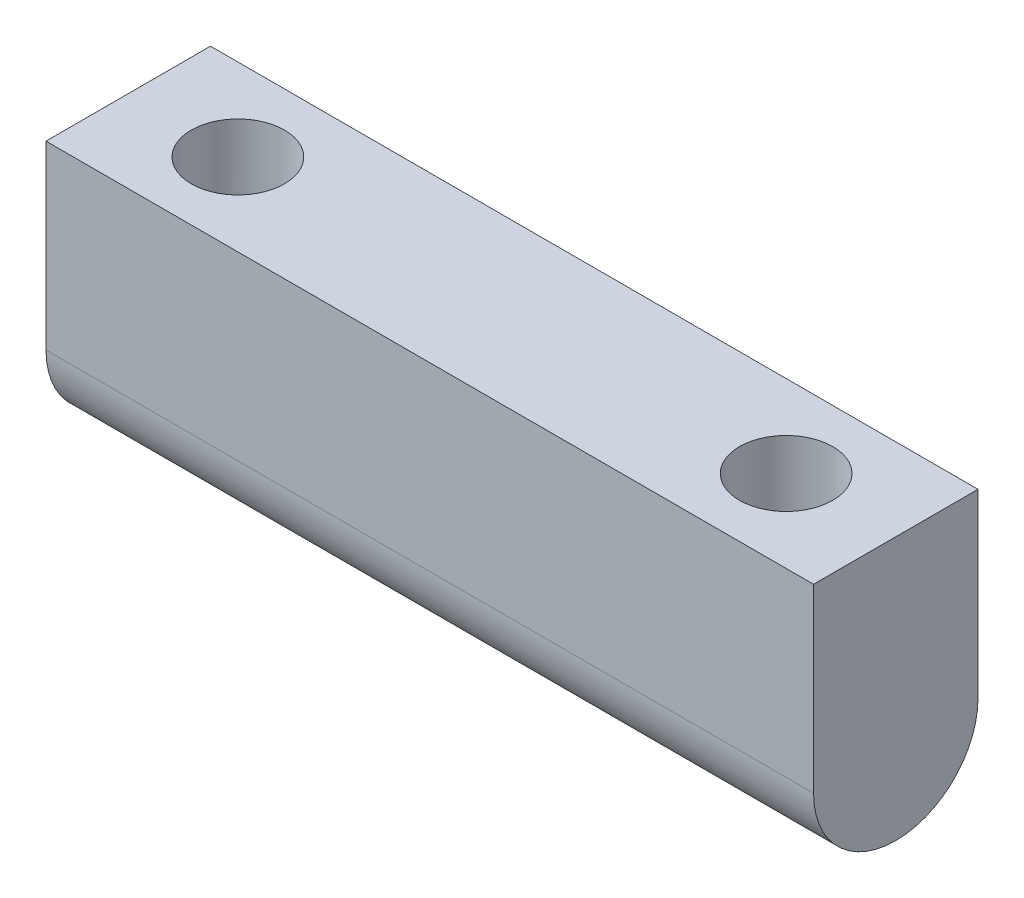
ISO-10303-21;
HEADER;
FILE_DESCRIPTION(('STEP AP214'),'2;1');
FILE_NAME('part.step','',(''),(''),'','','');
FILE_SCHEMA(('AUTOMOTIVE_DESIGN { 1 0 10303 214 1 1 1 1 }'));
ENDSEC;
DATA;
#1=APPLICATION_CONTEXT('core data for automotive mechanical design processes');
#2=APPLICATION_PROTOCOL_DEFINITION('international standard','automotive_design',2000,#1);
#3=PRODUCT_CONTEXT('',#1,'mechanical');
#4=PRODUCT('Part','Part','',(#3));
#5=PRODUCT_RELATED_PRODUCT_CATEGORY('part','',(#4));
#6=PRODUCT_DEFINITION_FORMATION('','',#4);
#7=PRODUCT_DEFINITION_CONTEXT('part definition',#1,'design');
#8=PRODUCT_DEFINITION('design','',#6,#7);
#9=PRODUCT_DEFINITION_SHAPE('','',#8);
#10=(LENGTH_UNIT() NAMED_UNIT(*) SI_UNIT(.MILLI.,.METRE.));
#11=(NAMED_UNIT(*) PLANE_ANGLE_UNIT() SI_UNIT($,.RADIAN.));
#12=(NAMED_UNIT(*) SI_UNIT($,.STERADIAN.) SOLID_ANGLE_UNIT());
#13=UNCERTAINTY_MEASURE_WITH_UNIT(LENGTH_MEASURE(1.E-05),#10,'distance_accuracy_value','');
#14=(GEOMETRIC_REPRESENTATION_CONTEXT(3) GLOBAL_UNCERTAINTY_ASSIGNED_CONTEXT((#13)) GLOBAL_UNIT_ASSIGNED_CONTEXT((#10,
#11,#12)) REPRESENTATION_CONTEXT('',''));
#15=CARTESIAN_POINT('',(0.,0.,0.));
#16=DIRECTION('',(0.,0.,1.));
#17=DIRECTION('',(1.,0.,0.));
#18=AXIS2_PLACEMENT_3D('',#15,#16,#17);
#19=CARTESIAN_POINT('',(0.,20.,0.));
#20=DIRECTION('',(0.,1.,0.));
#21=DIRECTION('',(0.,0.,1.));
#22=AXIS2_PLACEMENT_3D('',#19,#20,#21);
#23=PLANE('',#22);
#24=CARTESIAN_POINT('',(-25.,20.,0.));
#25=DIRECTION('',(0.,1.,0.));
#26=DIRECTION('',(0.,0.,1.));
#27=AXIS2_PLACEMENT_3D('',#24,#25,#26);
#28=CIRCLE('',#27,4.25);
#29=CARTESIAN_POINT('',(-25.,20.,4.25));
#30=VERTEX_POINT('',#29);
#31=EDGE_CURVE('E109',#30,#30,#28,.T.);
#32=ORIENTED_EDGE('',*,*,#31,.F.);
#33=EDGE_LOOP('',(#32));
#34=FACE_BOUND('',#33,.T.);
#35=DIRECTION('',(0.,0.,1.));
#36=VECTOR('',#35,1.);
#37=CARTESIAN_POINT('',(-35.,20.,7.5));
#38=LINE('',#37,#36);
#39=CARTESIAN_POINT('',(-35.,20.,-7.5));
#40=VERTEX_POINT('',#39);
#41=CARTESIAN_POINT('',(-35.,20.,7.5));
#42=VERTEX_POINT('',#41);
#43=EDGE_CURVE('E100',#40,#42,#38,.T.);
#44=ORIENTED_EDGE('',*,*,#43,.T.);
#45=DIRECTION('',(1.,0.,0.));
#46=VECTOR('',#45,1.);
#47=CARTESIAN_POINT('',(35.,20.,7.49999999999999));
#48=LINE('',#47,#46);
#49=CARTESIAN_POINT('',(35.,20.,7.49999999999999));
#50=VERTEX_POINT('',#49);
#51=EDGE_CURVE('E89',#42,#50,#48,.T.);
#52=ORIENTED_EDGE('',*,*,#51,.T.);
#53=DIRECTION('',(0.,0.,-1.));
#54=VECTOR('',#53,1.);
#55=CARTESIAN_POINT('',(35.,20.,7.49999999999999));
#56=LINE('',#55,#54);
#57=CARTESIAN_POINT('',(35.,20.,-7.50000000000001));
#58=VERTEX_POINT('',#57);
#59=EDGE_CURVE('E99',#50,#58,#56,.T.);
#60=ORIENTED_EDGE('',*,*,#59,.T.);
#61=DIRECTION('',(-1.,0.,0.));
#62=VECTOR('',#61,1.);
#63=CARTESIAN_POINT('',(35.,20.,-7.50000000000001));
#64=LINE('',#63,#62);
#65=EDGE_CURVE('E105',#58,#40,#64,.T.);
#66=ORIENTED_EDGE('',*,*,#65,.T.);
#67=EDGE_LOOP('',(#44,#52,#60,#66));
#68=FACE_BOUND('',#67,.T.);
#69=CARTESIAN_POINT('',(25.,20.,0.));
#70=DIRECTION('',(0.,1.,0.));
#71=DIRECTION('',(0.,0.,1.));
#72=AXIS2_PLACEMENT_3D('',#69,#70,#71);
#73=CIRCLE('',#72,4.25);
#74=CARTESIAN_POINT('',(25.,20.,4.25));
#75=VERTEX_POINT('',#74);
#76=EDGE_CURVE('E132',#75,#75,#73,.T.);
#77=ORIENTED_EDGE('',*,*,#76,.F.);
#78=EDGE_LOOP('',(#77));
#79=FACE_BOUND('',#78,.T.);
#80=ADVANCED_FACE('F42',(#34,#68,#79),#23,.T.);
#81=CARTESIAN_POINT('',(-35.,20.,7.5));
#82=DIRECTION('',(1.,0.,0.));
#83=DIRECTION('',(0.,0.,-1.));
#84=AXIS2_PLACEMENT_3D('',#81,#82,#83);
#85=PLANE('',#84);
#86=CARTESIAN_POINT('',(-35.,3.5,0.));
#87=DIRECTION('',(1.,0.,0.));
#88=DIRECTION('',(0.,0.,-1.));
#89=AXIS2_PLACEMENT_3D('',#86,#87,#88);
#90=CIRCLE('',#89,7.5);
#91=CARTESIAN_POINT('',(-35.,3.5,-7.5));
#92=VERTEX_POINT('',#91);
#93=CARTESIAN_POINT('',(-35.,-4.,0.));
#94=VERTEX_POINT('',#93);
#95=EDGE_CURVE('E114',#92,#94,#90,.F.);
#96=ORIENTED_EDGE('',*,*,#95,.T.);
#97=CARTESIAN_POINT('',(-35.,3.5,0.));
#98=DIRECTION('',(1.,0.,0.));
#99=DIRECTION('',(0.,0.,-1.));
#100=AXIS2_PLACEMENT_3D('',#97,#98,#99);
#101=CIRCLE('',#100,7.5);
#102=CARTESIAN_POINT('',(-35.,3.5,7.5));
#103=VERTEX_POINT('',#102);
#104=EDGE_CURVE('E113',#94,#103,#101,.F.);
#105=ORIENTED_EDGE('',*,*,#104,.T.);
#106=DIRECTION('',(0.,-1.,0.));
#107=VECTOR('',#106,1.);
#108=CARTESIAN_POINT('',(-35.,20.,7.5));
#109=LINE('',#108,#107);
#110=EDGE_CURVE('E94',#42,#103,#109,.T.);
#111=ORIENTED_EDGE('',*,*,#110,.F.);
#112=ORIENTED_EDGE('',*,*,#43,.F.);
#113=DIRECTION('',(0.,-1.,0.));
#114=VECTOR('',#113,1.);
#115=CARTESIAN_POINT('',(-35.,20.,-7.5));
#116=LINE('',#115,#114);
#117=EDGE_CURVE('E191',#40,#92,#116,.T.);
#118=ORIENTED_EDGE('',*,*,#117,.T.);
#119=EDGE_LOOP('',(#96,#105,#111,#112,#118));
#120=FACE_BOUND('',#119,.T.);
#121=ADVANCED_FACE('F111',(#120),#85,.F.);
#122=CARTESIAN_POINT('',(35.,20.,7.49999999999999));
#123=DIRECTION('',(0.,0.,-1.));
#124=DIRECTION('',(-1.,0.,0.));
#125=AXIS2_PLACEMENT_3D('',#122,#123,#124);
#126=PLANE('',#125);
#127=ORIENTED_EDGE('',*,*,#110,.T.);
#128=DIRECTION('',(-1.,0.,0.));
#129=VECTOR('',#128,1.);
#130=CARTESIAN_POINT('',(35.,3.5,7.49999999999999));
#131=LINE('',#130,#129);
#132=CARTESIAN_POINT('',(35.,3.5,7.49999999999999));
#133=VERTEX_POINT('',#132);
#134=EDGE_CURVE('E122',#103,#133,#131,.F.);
#135=ORIENTED_EDGE('',*,*,#134,.T.);
#136=DIRECTION('',(0.,-1.,0.));
#137=VECTOR('',#136,1.);
#138=CARTESIAN_POINT('',(35.,20.,7.49999999999999));
#139=LINE('',#138,#137);
#140=EDGE_CURVE('E96',#50,#133,#139,.T.);
#141=ORIENTED_EDGE('',*,*,#140,.F.);
#142=ORIENTED_EDGE('',*,*,#51,.F.);
#143=EDGE_LOOP('',(#127,#135,#141,#142));
#144=FACE_BOUND('',#143,.T.);
#145=ADVANCED_FACE('F91',(#144),#126,.F.);
#146=CARTESIAN_POINT('',(35.,20.,7.49999999999999));
#147=DIRECTION('',(-1.,0.,0.));
#148=DIRECTION('',(0.,0.,1.));
#149=AXIS2_PLACEMENT_3D('',#146,#147,#148);
#150=PLANE('',#149);
#151=ORIENTED_EDGE('',*,*,#140,.T.);
#152=CARTESIAN_POINT('',(35.,3.5,0.));
#153=DIRECTION('',(-1.,0.,0.));
#154=DIRECTION('',(0.,0.,1.));
#155=AXIS2_PLACEMENT_3D('',#152,#153,#154);
#156=CIRCLE('',#155,7.5);
#157=CARTESIAN_POINT('',(35.,-4.,0.));
#158=VERTEX_POINT('',#157);
#159=EDGE_CURVE('E63',#133,#158,#156,.F.);
#160=ORIENTED_EDGE('',*,*,#159,.T.);
#161=CARTESIAN_POINT('',(35.,3.5,0.));
#162=DIRECTION('',(-1.,0.,0.));
#163=DIRECTION('',(0.,0.,1.));
#164=AXIS2_PLACEMENT_3D('',#161,#162,#163);
#165=CIRCLE('',#164,7.5);
#166=CARTESIAN_POINT('',(35.,3.5,-7.50000000000001));
#167=VERTEX_POINT('',#166);
#168=EDGE_CURVE('E58',#158,#167,#165,.F.);
#169=ORIENTED_EDGE('',*,*,#168,.T.);
#170=DIRECTION('',(0.,-1.,0.));
#171=VECTOR('',#170,1.);
#172=CARTESIAN_POINT('',(35.,20.,-7.50000000000001));
#173=LINE('',#172,#171);
#174=EDGE_CURVE('E117',#58,#167,#173,.T.);
#175=ORIENTED_EDGE('',*,*,#174,.F.);
#176=ORIENTED_EDGE('',*,*,#59,.F.);
#177=EDGE_LOOP('',(#151,#160,#169,#175,#176));
#178=FACE_BOUND('',#177,.T.);
#179=ADVANCED_FACE('F166',(#178),#150,.F.);
#180=CARTESIAN_POINT('',(35.,20.,-7.50000000000001));
#181=DIRECTION('',(0.,0.,1.));
#182=DIRECTION('',(1.,0.,0.));
#183=AXIS2_PLACEMENT_3D('',#180,#181,#182);
#184=PLANE('',#183);
#185=ORIENTED_EDGE('',*,*,#174,.T.);
#186=DIRECTION('',(1.,0.,0.));
#187=VECTOR('',#186,1.);
#188=CARTESIAN_POINT('',(-35.,3.5,-7.5));
#189=LINE('',#188,#187);
#190=EDGE_CURVE('E126',#167,#92,#189,.F.);
#191=ORIENTED_EDGE('',*,*,#190,.T.);
#192=ORIENTED_EDGE('',*,*,#117,.F.);
#193=ORIENTED_EDGE('',*,*,#65,.F.);
#194=EDGE_LOOP('',(#185,#191,#192,#193));
#195=FACE_BOUND('',#194,.T.);
#196=ADVANCED_FACE('F163',(#195),#184,.F.);
#197=CARTESIAN_POINT('',(-25.,20.,0.));
#198=DIRECTION('',(0.,-1.,0.));
#199=DIRECTION('',(0.,0.,-1.));
#200=AXIS2_PLACEMENT_3D('',#197,#198,#199);
#201=CYLINDRICAL_SURFACE('',#200,4.25);
#202=CARTESIAN_POINT('',(-25.,9.99999999998724,0.));
#203=DIRECTION('',(0.,-1.,0.));
#204=DIRECTION('',(0.,0.,-1.));
#205=AXIS2_PLACEMENT_3D('',#202,#203,#204);
#206=CIRCLE('',#205,4.25);
#207=CARTESIAN_POINT('',(-25.,9.99999999998724,-4.25));
#208=VERTEX_POINT('',#207);
#209=EDGE_CURVE('E11',#208,#208,#206,.T.);
#210=ORIENTED_EDGE('',*,*,#209,.T.);
#211=EDGE_LOOP('',(#210));
#212=FACE_BOUND('',#211,.T.);
#213=ORIENTED_EDGE('',*,*,#31,.T.);
#214=EDGE_LOOP('',(#213));
#215=FACE_BOUND('',#214,.T.);
#216=ADVANCED_FACE('F161',(#212,#215),#201,.F.);
#217=CARTESIAN_POINT('',(25.,20.,0.));
#218=DIRECTION('',(0.,-1.,0.));
#219=DIRECTION('',(0.,0.,-1.));
#220=AXIS2_PLACEMENT_3D('',#217,#218,#219);
#221=CYLINDRICAL_SURFACE('',#220,4.25);
#222=CARTESIAN_POINT('',(25.,9.99999999998724,0.));
#223=DIRECTION('',(0.,-1.,0.));
#224=DIRECTION('',(0.,0.,-1.));
#225=AXIS2_PLACEMENT_3D('',#222,#223,#224);
#226=CIRCLE('',#225,4.25);
#227=CARTESIAN_POINT('',(25.,9.99999999998724,-4.25));
#228=VERTEX_POINT('',#227);
#229=EDGE_CURVE('E135',#228,#228,#226,.T.);
#230=ORIENTED_EDGE('',*,*,#229,.T.);
#231=EDGE_LOOP('',(#230));
#232=FACE_BOUND('',#231,.T.);
#233=ORIENTED_EDGE('',*,*,#76,.T.);
#234=EDGE_LOOP('',(#233));
#235=FACE_BOUND('',#234,.T.);
#236=ADVANCED_FACE('F201',(#232,#235),#221,.F.);
#237=CARTESIAN_POINT('',(0.,0.,0.));
#238=DIRECTION('',(0.,-1.,0.));
#239=DIRECTION('',(0.,0.,-1.));
#240=AXIS2_PLACEMENT_3D('',#237,#238,#239);
#241=PLANE('',#240);
#242=CARTESIAN_POINT('',(25.,0.,0.));
#243=DIRECTION('',(0.,-1.,0.));
#244=DIRECTION('',(0.,0.,-1.));
#245=AXIS2_PLACEMENT_3D('',#242,#243,#244);
#246=CIRCLE('',#245,4.07544935071801);
#247=CARTESIAN_POINT('',(25.,0.,-4.07544935071801));
#248=VERTEX_POINT('',#247);
#249=EDGE_CURVE('E128',#248,#248,#246,.F.);
#250=ORIENTED_EDGE('',*,*,#249,.T.);
#251=EDGE_LOOP('',(#250));
#252=FACE_BOUND('',#251,.T.);
#253=ADVANCED_FACE('F186',(#252),#241,.F.);
#254=CARTESIAN_POINT('',(-25.,0.,0.));
#255=DIRECTION('',(0.,-1.,0.));
#256=DIRECTION('',(0.,0.,-1.));
#257=AXIS2_PLACEMENT_3D('',#254,#255,#256);
#258=CIRCLE('',#257,4.07544935071801);
#259=CARTESIAN_POINT('',(-25.,0.,-4.07544935071801));
#260=VERTEX_POINT('',#259);
#261=EDGE_CURVE('E51',#260,#260,#258,.F.);
#262=ORIENTED_EDGE('',*,*,#261,.T.);
#263=EDGE_LOOP('',(#262));
#264=FACE_BOUND('',#263,.T.);
#265=ADVANCED_FACE('F140',(#264),#241,.F.);
#266=CARTESIAN_POINT('',(0.,3.5,0.));
#267=DIRECTION('',(-1.,0.,0.));
#268=DIRECTION('',(0.,0.,1.));
#269=AXIS2_PLACEMENT_3D('',#266,#267,#268);
#270=CYLINDRICAL_SURFACE('',#269,7.5);
#271=ORIENTED_EDGE('',*,*,#190,.F.);
#272=ORIENTED_EDGE('',*,*,#168,.F.);
#273=DIRECTION('',(1.,0.,0.));
#274=VECTOR('',#273,1.);
#275=CARTESIAN_POINT('',(35.,-4.,0.));
#276=LINE('',#275,#274);
#277=EDGE_CURVE('E129',#94,#158,#276,.T.);
#278=ORIENTED_EDGE('',*,*,#277,.F.);
#279=ORIENTED_EDGE('',*,*,#95,.F.);
#280=EDGE_LOOP('',(#271,#272,#278,#279));
#281=FACE_BOUND('',#280,.T.);
#282=ADVANCED_FACE('F174',(#281),#270,.T.);
#283=CARTESIAN_POINT('',(0.,3.5,0.));
#284=DIRECTION('',(1.,0.,0.));
#285=DIRECTION('',(0.,0.,-1.));
#286=AXIS2_PLACEMENT_3D('',#283,#284,#285);
#287=CYLINDRICAL_SURFACE('',#286,7.5);
#288=ORIENTED_EDGE('',*,*,#159,.F.);
#289=ORIENTED_EDGE('',*,*,#134,.F.);
#290=ORIENTED_EDGE('',*,*,#104,.F.);
#291=ORIENTED_EDGE('',*,*,#277,.T.);
#292=EDGE_LOOP('',(#288,#289,#290,#291));
#293=FACE_BOUND('',#292,.T.);
#294=ADVANCED_FACE('F148',(#293),#287,.T.);
#295=CARTESIAN_POINT('',(25.,0.,0.));
#296=DIRECTION('',(0.,1.,0.));
#297=DIRECTION('',(0.,0.,1.));
#298=AXIS2_PLACEMENT_3D('',#295,#296,#297);
#299=CONICAL_SURFACE('',#298,4.07544935071801,0.0174532925199468);
#300=ORIENTED_EDGE('',*,*,#229,.F.);
#301=EDGE_LOOP('',(#300));
#302=FACE_BOUND('',#301,.T.);
#303=ORIENTED_EDGE('',*,*,#249,.F.);
#304=EDGE_LOOP('',(#303));
#305=FACE_BOUND('',#304,.T.);
#306=ADVANCED_FACE('F143',(#302,#305),#299,.F.);
#307=CARTESIAN_POINT('',(-25.,0.,0.));
#308=DIRECTION('',(0.,1.,0.));
#309=DIRECTION('',(0.,0.,1.));
#310=AXIS2_PLACEMENT_3D('',#307,#308,#309);
#311=CONICAL_SURFACE('',#310,4.07544935071801,0.0174532925199468);
#312=ORIENTED_EDGE('',*,*,#209,.F.);
#313=EDGE_LOOP('',(#312));
#314=FACE_BOUND('',#313,.T.);
#315=ORIENTED_EDGE('',*,*,#261,.F.);
#316=EDGE_LOOP('',(#315));
#317=FACE_BOUND('',#316,.T.);
#318=ADVANCED_FACE('F45',(#314,#317),#311,.F.);
#319=CLOSED_SHELL('',(#80,#121,#145,#179,#196,#216,#236,#253,#265,#282,#294,#306,#318));
#320=MANIFOLD_SOLID_BREP('B2',#319);
#321=ADVANCED_BREP_SHAPE_REPRESENTATION('',(#18,#320),#14);
#322=SHAPE_DEFINITION_REPRESENTATION(#9,#321);
ENDSEC;
END-ISO-10303-21;
